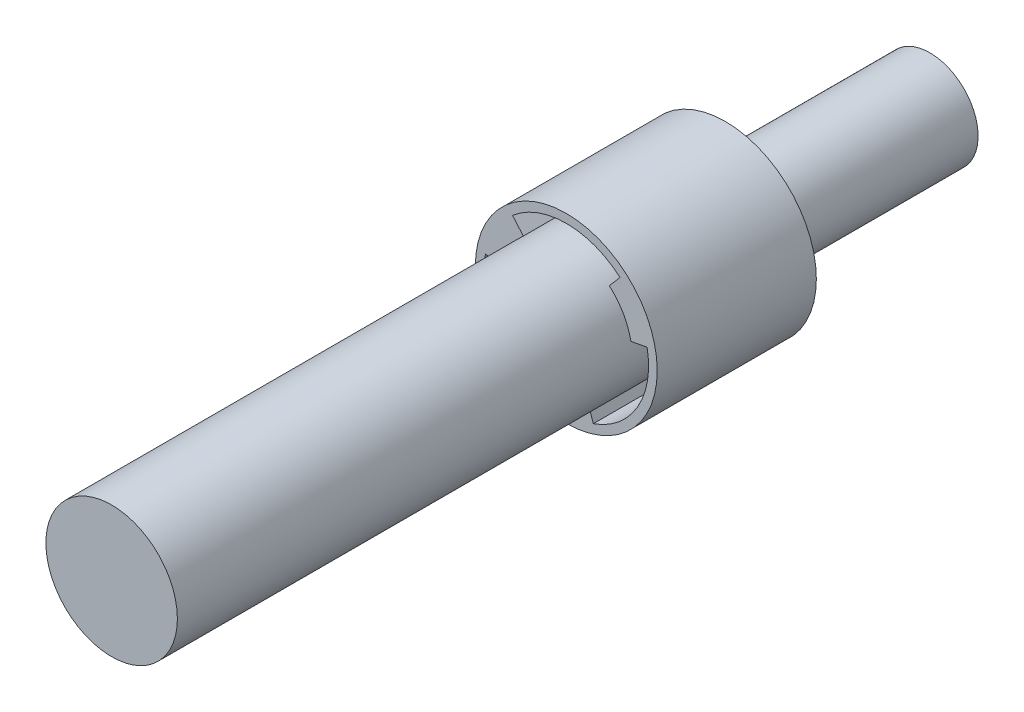
ISO-10303-21;
HEADER;
FILE_DESCRIPTION(('STEP AP214'),'2;1');
FILE_NAME('part.step','',(''),(''),'','','');
FILE_SCHEMA(('AUTOMOTIVE_DESIGN { 1 0 10303 214 1 1 1 1 }'));
ENDSEC;
DATA;
#1=APPLICATION_CONTEXT('core data for automotive mechanical design processes');
#2=APPLICATION_PROTOCOL_DEFINITION('international standard','automotive_design',2000,#1);
#3=PRODUCT_CONTEXT('',#1,'mechanical');
#4=PRODUCT('Part','Part','',(#3));
#5=PRODUCT_RELATED_PRODUCT_CATEGORY('part','',(#4));
#6=PRODUCT_DEFINITION_FORMATION('','',#4);
#7=PRODUCT_DEFINITION_CONTEXT('part definition',#1,'design');
#8=PRODUCT_DEFINITION('design','',#6,#7);
#9=PRODUCT_DEFINITION_SHAPE('','',#8);
#10=(LENGTH_UNIT() NAMED_UNIT(*) SI_UNIT(.MILLI.,.METRE.));
#11=(NAMED_UNIT(*) PLANE_ANGLE_UNIT() SI_UNIT($,.RADIAN.));
#12=(NAMED_UNIT(*) SI_UNIT($,.STERADIAN.) SOLID_ANGLE_UNIT());
#13=UNCERTAINTY_MEASURE_WITH_UNIT(LENGTH_MEASURE(1.E-05),#10,'distance_accuracy_value','');
#14=(GEOMETRIC_REPRESENTATION_CONTEXT(3) GLOBAL_UNCERTAINTY_ASSIGNED_CONTEXT((#13)) GLOBAL_UNIT_ASSIGNED_CONTEXT((#10,
#11,#12)) REPRESENTATION_CONTEXT('',''));
#15=CARTESIAN_POINT('',(0.,0.,0.));
#16=DIRECTION('',(0.,0.,1.));
#17=DIRECTION('',(1.,0.,0.));
#18=AXIS2_PLACEMENT_3D('',#15,#16,#17);
#19=CARTESIAN_POINT('',(0.,0.,101.6));
#20=DIRECTION('',(0.,0.,-1.));
#21=DIRECTION('',(-1.,0.,0.));
#22=AXIS2_PLACEMENT_3D('',#19,#20,#21);
#23=CYLINDRICAL_SURFACE('',#22,14.6939);
#24=CARTESIAN_POINT('',(0.,0.,101.6));
#25=DIRECTION('',(0.,0.,1.));
#26=DIRECTION('',(1.,0.,0.));
#27=AXIS2_PLACEMENT_3D('',#24,#25,#26);
#28=CIRCLE('',#27,14.6939);
#29=CARTESIAN_POINT('',(14.6939,0.,101.6));
#30=VERTEX_POINT('',#29);
#31=EDGE_CURVE('E40',#30,#30,#28,.T.);
#32=ORIENTED_EDGE('',*,*,#31,.F.);
#33=EDGE_LOOP('',(#32));
#34=FACE_BOUND('',#33,.T.);
#35=CARTESIAN_POINT('',(0.,0.,0.));
#36=DIRECTION('',(0.,0.,1.));
#37=DIRECTION('',(1.,0.,0.));
#38=AXIS2_PLACEMENT_3D('',#35,#36,#37);
#39=CIRCLE('',#38,14.6939);
#40=CARTESIAN_POINT('',(14.4332299985732,2.75546167062584,0.));
#41=VERTEX_POINT('',#40);
#42=CARTESIAN_POINT('',(9.60291480520306,11.1218130021149,0.));
#43=VERTEX_POINT('',#42);
#44=EDGE_CURVE('E35',#41,#43,#39,.T.);
#45=ORIENTED_EDGE('',*,*,#44,.T.);
#46=DIRECTION('',(0.,0.,1.));
#47=VECTOR('',#46,1.);
#48=CARTESIAN_POINT('',(9.60291480520306,11.1218130021149,-14.1986));
#49=LINE('',#48,#47);
#50=CARTESIAN_POINT('',(9.60291480520306,11.1218130021149,-14.1986));
#51=VERTEX_POINT('',#50);
#52=EDGE_CURVE('E151',#51,#43,#49,.T.);
#53=ORIENTED_EDGE('',*,*,#52,.F.);
#54=CARTESIAN_POINT('',(0.,0.,-14.1986));
#55=DIRECTION('',(0.,0.,1.));
#56=DIRECTION('',(1.,0.,0.));
#57=AXIS2_PLACEMENT_3D('',#54,#55,#56);
#58=CIRCLE('',#57,14.6939);
#59=CARTESIAN_POINT('',(-9.60291480520291,11.121813002115,-14.1986));
#60=VERTEX_POINT('',#59);
#61=EDGE_CURVE('E168',#60,#51,#58,.F.);
#62=ORIENTED_EDGE('',*,*,#61,.F.);
#63=DIRECTION('',(0.,0.,1.));
#64=VECTOR('',#63,1.);
#65=CARTESIAN_POINT('',(-9.60291480520291,11.121813002115,-14.1986));
#66=LINE('',#65,#64);
#67=CARTESIAN_POINT('',(-9.60291480520291,11.121813002115,0.));
#68=VERTEX_POINT('',#67);
#69=EDGE_CURVE('E179',#60,#68,#66,.T.);
#70=ORIENTED_EDGE('',*,*,#69,.T.);
#71=CARTESIAN_POINT('',(-14.4332299985731,2.75546167062604,0.));
#72=VERTEX_POINT('',#71);
#73=EDGE_CURVE('E224',#68,#72,#39,.T.);
#74=ORIENTED_EDGE('',*,*,#73,.T.);
#75=DIRECTION('',(0.,0.,1.));
#76=VECTOR('',#75,1.);
#77=CARTESIAN_POINT('',(-14.4332299985731,2.75546167062604,-14.1986));
#78=LINE('',#77,#76);
#79=CARTESIAN_POINT('',(-14.4332299985731,2.75546167062604,-14.1986));
#80=VERTEX_POINT('',#79);
#81=EDGE_CURVE('E203',#80,#72,#78,.T.);
#82=ORIENTED_EDGE('',*,*,#81,.F.);
#83=CARTESIAN_POINT('',(0.,0.,-14.1986));
#84=DIRECTION('',(0.,0.,1.));
#85=DIRECTION('',(1.,0.,0.));
#86=AXIS2_PLACEMENT_3D('',#83,#84,#85);
#87=CIRCLE('',#86,14.6939);
#88=CARTESIAN_POINT('',(-4.83031519337016,-13.8772746727409,-14.1986));
#89=VERTEX_POINT('',#88);
#90=EDGE_CURVE('E193',#89,#80,#87,.F.);
#91=ORIENTED_EDGE('',*,*,#90,.F.);
#92=DIRECTION('',(0.,0.,1.));
#93=VECTOR('',#92,1.);
#94=CARTESIAN_POINT('',(-4.83031519337016,-13.8772746727409,-14.1986));
#95=LINE('',#94,#93);
#96=CARTESIAN_POINT('',(-4.83031519337016,-13.8772746727409,0.));
#97=VERTEX_POINT('',#96);
#98=EDGE_CURVE('E206',#89,#97,#95,.T.);
#99=ORIENTED_EDGE('',*,*,#98,.T.);
#100=CARTESIAN_POINT('',(4.83031519337016,-13.8772746727409,0.));
#101=VERTEX_POINT('',#100);
#102=EDGE_CURVE('E218',#97,#101,#39,.T.);
#103=ORIENTED_EDGE('',*,*,#102,.T.);
#104=DIRECTION('',(0.,0.,1.));
#105=VECTOR('',#104,1.);
#106=CARTESIAN_POINT('',(4.83031519337016,-13.8772746727409,-14.1986));
#107=LINE('',#106,#105);
#108=CARTESIAN_POINT('',(4.83031519337016,-13.8772746727409,-14.1986));
#109=VERTEX_POINT('',#108);
#110=EDGE_CURVE('E153',#109,#101,#107,.T.);
#111=ORIENTED_EDGE('',*,*,#110,.F.);
#112=CARTESIAN_POINT('',(0.,0.,-14.1986));
#113=DIRECTION('',(0.,0.,1.));
#114=DIRECTION('',(1.,0.,0.));
#115=AXIS2_PLACEMENT_3D('',#112,#113,#114);
#116=CIRCLE('',#115,14.6939);
#117=CARTESIAN_POINT('',(14.4332299985732,2.75546167062584,-14.1986));
#118=VERTEX_POINT('',#117);
#119=EDGE_CURVE('E130',#118,#109,#116,.F.);
#120=ORIENTED_EDGE('',*,*,#119,.F.);
#121=DIRECTION('',(0.,0.,1.));
#122=VECTOR('',#121,1.);
#123=CARTESIAN_POINT('',(14.4332299985732,2.75546167062584,-14.1986));
#124=LINE('',#123,#122);
#125=EDGE_CURVE('E156',#118,#41,#124,.T.);
#126=ORIENTED_EDGE('',*,*,#125,.T.);
#127=EDGE_LOOP('',(#45,#53,#62,#70,#74,#82,#91,#99,#103,#111,#120,#126));
#128=FACE_BOUND('',#127,.T.);
#129=ADVANCED_FACE('F32',(#34,#128),#23,.T.);
#130=CARTESIAN_POINT('',(0.,0.,101.6));
#131=DIRECTION('',(0.,0.,1.));
#132=DIRECTION('',(1.,0.,0.));
#133=AXIS2_PLACEMENT_3D('',#130,#131,#132);
#134=PLANE('',#133);
#135=ORIENTED_EDGE('',*,*,#31,.T.);
#136=EDGE_LOOP('',(#135));
#137=FACE_BOUND('',#136,.T.);
#138=ADVANCED_FACE('F251',(#137),#134,.T.);
#139=CARTESIAN_POINT('',(0.,0.,-35.56));
#140=DIRECTION('',(0.,0.,1.));
#141=DIRECTION('',(1.,0.,0.));
#142=AXIS2_PLACEMENT_3D('',#139,#140,#141);
#143=CYLINDRICAL_SURFACE('',#142,20.32);
#144=CARTESIAN_POINT('',(0.,0.,-35.56));
#145=DIRECTION('',(0.,0.,-1.));
#146=DIRECTION('',(-1.,0.,0.));
#147=AXIS2_PLACEMENT_3D('',#144,#145,#146);
#148=CIRCLE('',#147,20.32);
#149=CARTESIAN_POINT('',(-20.32,0.,-35.56));
#150=VERTEX_POINT('',#149);
#151=EDGE_CURVE('E215',#150,#150,#148,.T.);
#152=ORIENTED_EDGE('',*,*,#151,.F.);
#153=EDGE_LOOP('',(#152));
#154=FACE_BOUND('',#153,.T.);
#155=CARTESIAN_POINT('',(0.,0.,0.));
#156=DIRECTION('',(0.,0.,-1.));
#157=DIRECTION('',(-1.,0.,0.));
#158=AXIS2_PLACEMENT_3D('',#155,#156,#157);
#159=CIRCLE('',#158,20.32);
#160=CARTESIAN_POINT('',(-20.32,0.,0.));
#161=VERTEX_POINT('',#160);
#162=EDGE_CURVE('E213',#161,#161,#159,.T.);
#163=ORIENTED_EDGE('',*,*,#162,.T.);
#164=EDGE_LOOP('',(#163));
#165=FACE_BOUND('',#164,.T.);
#166=ADVANCED_FACE('F258',(#154,#165),#143,.T.);
#167=CARTESIAN_POINT('',(0.,0.,-35.56));
#168=DIRECTION('',(0.,0.,-1.));
#169=DIRECTION('',(-1.,0.,0.));
#170=AXIS2_PLACEMENT_3D('',#167,#168,#169);
#171=PLANE('',#170);
#172=CARTESIAN_POINT('',(0.,0.,-35.56));
#173=DIRECTION('',(0.,0.,-1.));
#174=DIRECTION('',(-1.,0.,0.));
#175=AXIS2_PLACEMENT_3D('',#172,#173,#174);
#176=CIRCLE('',#175,10.7442);
#177=CARTESIAN_POINT('',(-10.7442,0.,-35.56));
#178=VERTEX_POINT('',#177);
#179=EDGE_CURVE('E11',#178,#178,#176,.T.);
#180=ORIENTED_EDGE('',*,*,#179,.F.);
#181=EDGE_LOOP('',(#180));
#182=FACE_BOUND('',#181,.T.);
#183=ORIENTED_EDGE('',*,*,#151,.T.);
#184=EDGE_LOOP('',(#183));
#185=FACE_BOUND('',#184,.T.);
#186=ADVANCED_FACE('F262',(#182,#185),#171,.T.);
#187=CARTESIAN_POINT('',(0.,0.,0.));
#188=DIRECTION('',(0.,0.,-1.));
#189=DIRECTION('',(-1.,0.,0.));
#190=AXIS2_PLACEMENT_3D('',#187,#188,#189);
#191=PLANE('',#190);
#192=CARTESIAN_POINT('',(0.,0.,0.));
#193=DIRECTION('',(0.,0.,1.));
#194=DIRECTION('',(1.,0.,0.));
#195=AXIS2_PLACEMENT_3D('',#192,#193,#194);
#196=CIRCLE('',#195,18.3896);
#197=CARTESIAN_POINT('',(12.0181682263907,13.9190883552829,0.));
#198=VERTEX_POINT('',#197);
#199=CARTESIAN_POINT('',(-12.0181682263905,13.9190883552831,0.));
#200=VERTEX_POINT('',#199);
#201=EDGE_CURVE('E173',#198,#200,#196,.T.);
#202=ORIENTED_EDGE('',*,*,#201,.F.);
#203=DIRECTION('',(0.653530703571078,0.756900006268921,0.));
#204=VECTOR('',#203,1.);
#205=CARTESIAN_POINT('',(0.,0.,0.));
#206=LINE('',#205,#204);
#207=EDGE_CURVE('E48',#43,#198,#206,.T.);
#208=ORIENTED_EDGE('',*,*,#207,.F.);
#209=ORIENTED_EDGE('',*,*,#44,.F.);
#210=DIRECTION('',(0.982259985339029,0.187524188311193,0.));
#211=VECTOR('',#210,1.);
#212=CARTESIAN_POINT('',(0.,0.,0.));
#213=LINE('',#212,#211);
#214=CARTESIAN_POINT('',(18.0633682263906,3.44849481336751,0.));
#215=VERTEX_POINT('',#214);
#216=EDGE_CURVE('E142',#41,#215,#213,.T.);
#217=ORIENTED_EDGE('',*,*,#216,.T.);
#218=CARTESIAN_POINT('',(0.,0.,0.));
#219=DIRECTION('',(0.,0.,1.));
#220=DIRECTION('',(1.,0.,0.));
#221=AXIS2_PLACEMENT_3D('',#218,#219,#220);
#222=CIRCLE('',#221,18.3896);
#223=CARTESIAN_POINT('',(6.0452,-17.3675831686507,0.));
#224=VERTEX_POINT('',#223);
#225=EDGE_CURVE('E145',#224,#215,#222,.T.);
#226=ORIENTED_EDGE('',*,*,#225,.F.);
#227=DIRECTION('',(0.328729281767956,-0.944424194580128,0.));
#228=VECTOR('',#227,1.);
#229=CARTESIAN_POINT('',(0.,0.,0.));
#230=LINE('',#229,#228);
#231=EDGE_CURVE('E56',#101,#224,#230,.T.);
#232=ORIENTED_EDGE('',*,*,#231,.F.);
#233=ORIENTED_EDGE('',*,*,#102,.F.);
#234=DIRECTION('',(-0.328729281767956,-0.944424194580128,0.));
#235=VECTOR('',#234,1.);
#236=CARTESIAN_POINT('',(0.,0.,0.));
#237=LINE('',#236,#235);
#238=CARTESIAN_POINT('',(-6.0452,-17.3675831686507,0.));
#239=VERTEX_POINT('',#238);
#240=EDGE_CURVE('E188',#97,#239,#237,.T.);
#241=ORIENTED_EDGE('',*,*,#240,.T.);
#242=CARTESIAN_POINT('',(0.,0.,0.));
#243=DIRECTION('',(0.,0.,1.));
#244=DIRECTION('',(1.,0.,0.));
#245=AXIS2_PLACEMENT_3D('',#242,#243,#244);
#246=CIRCLE('',#245,18.3896);
#247=CARTESIAN_POINT('',(-18.0633682263906,3.44849481336776,0.));
#248=VERTEX_POINT('',#247);
#249=EDGE_CURVE('E198',#248,#239,#246,.T.);
#250=ORIENTED_EDGE('',*,*,#249,.F.);
#251=DIRECTION('',(-0.982259985339026,0.187524188311206,0.));
#252=VECTOR('',#251,1.);
#253=CARTESIAN_POINT('',(0.,0.,0.));
#254=LINE('',#253,#252);
#255=EDGE_CURVE('E155',#72,#248,#254,.T.);
#256=ORIENTED_EDGE('',*,*,#255,.F.);
#257=ORIENTED_EDGE('',*,*,#73,.F.);
#258=DIRECTION('',(-0.653530703571067,0.75690000626893,0.));
#259=VECTOR('',#258,1.);
#260=CARTESIAN_POINT('',(0.,0.,0.));
#261=LINE('',#260,#259);
#262=EDGE_CURVE('E163',#68,#200,#261,.T.);
#263=ORIENTED_EDGE('',*,*,#262,.T.);
#264=EDGE_LOOP('',(#202,#208,#209,#217,#226,#232,#233,#241,#250,#256,#257,#263));
#265=FACE_BOUND('',#264,.T.);
#266=ORIENTED_EDGE('',*,*,#162,.F.);
#267=EDGE_LOOP('',(#266));
#268=FACE_BOUND('',#267,.T.);
#269=ADVANCED_FACE('F234',(#265,#268),#191,.F.);
#270=CARTESIAN_POINT('',(0.,0.,-81.28));
#271=DIRECTION('',(0.,0.,1.));
#272=DIRECTION('',(1.,0.,0.));
#273=AXIS2_PLACEMENT_3D('',#270,#271,#272);
#274=CYLINDRICAL_SURFACE('',#273,10.7442);
#275=CARTESIAN_POINT('',(0.,0.,-81.28));
#276=DIRECTION('',(0.,0.,-1.));
#277=DIRECTION('',(-1.,0.,0.));
#278=AXIS2_PLACEMENT_3D('',#275,#276,#277);
#279=CIRCLE('',#278,10.7442);
#280=CARTESIAN_POINT('',(-10.7442,0.,-81.28));
#281=VERTEX_POINT('',#280);
#282=EDGE_CURVE('E205',#281,#281,#279,.T.);
#283=ORIENTED_EDGE('',*,*,#282,.F.);
#284=EDGE_LOOP('',(#283));
#285=FACE_BOUND('',#284,.T.);
#286=ORIENTED_EDGE('',*,*,#179,.T.);
#287=EDGE_LOOP('',(#286));
#288=FACE_BOUND('',#287,.T.);
#289=ADVANCED_FACE('F268',(#285,#288),#274,.T.);
#290=CARTESIAN_POINT('',(0.,0.,-81.28));
#291=DIRECTION('',(0.,0.,-1.));
#292=DIRECTION('',(-1.,0.,0.));
#293=AXIS2_PLACEMENT_3D('',#290,#291,#292);
#294=PLANE('',#293);
#295=ORIENTED_EDGE('',*,*,#282,.T.);
#296=EDGE_LOOP('',(#295));
#297=FACE_BOUND('',#296,.T.);
#298=ADVANCED_FACE('F274',(#297),#294,.T.);
#299=CARTESIAN_POINT('',(0.,0.,-14.1986));
#300=DIRECTION('',(0.187524188311206,0.982259985339026,0.));
#301=DIRECTION('',(-0.982259985339026,0.187524188311206,0.));
#302=AXIS2_PLACEMENT_3D('',#299,#300,#301);
#303=PLANE('',#302);
#304=ORIENTED_EDGE('',*,*,#255,.T.);
#305=DIRECTION('',(0.,0.,1.));
#306=VECTOR('',#305,1.);
#307=CARTESIAN_POINT('',(-18.0633682263906,3.44849481336776,-14.1986));
#308=LINE('',#307,#306);
#309=CARTESIAN_POINT('',(-18.0633682263906,3.44849481336776,-14.1986));
#310=VERTEX_POINT('',#309);
#311=EDGE_CURVE('E196',#310,#248,#308,.T.);
#312=ORIENTED_EDGE('',*,*,#311,.F.);
#313=DIRECTION('',(-0.982259985339026,0.187524188311206,0.));
#314=VECTOR('',#313,1.);
#315=CARTESIAN_POINT('',(0.,0.,-14.1986));
#316=LINE('',#315,#314);
#317=EDGE_CURVE('E184',#80,#310,#316,.T.);
#318=ORIENTED_EDGE('',*,*,#317,.F.);
#319=ORIENTED_EDGE('',*,*,#81,.T.);
#320=EDGE_LOOP('',(#304,#312,#318,#319));
#321=FACE_BOUND('',#320,.T.);
#322=ADVANCED_FACE('F277',(#321),#303,.F.);
#323=CARTESIAN_POINT('',(0.,0.,-14.1986));
#324=DIRECTION('',(-0.944424194580128,0.328729281767956,0.));
#325=DIRECTION('',(-0.328729281767956,-0.944424194580128,0.));
#326=AXIS2_PLACEMENT_3D('',#323,#324,#325);
#327=PLANE('',#326);
#328=ORIENTED_EDGE('',*,*,#240,.F.);
#329=ORIENTED_EDGE('',*,*,#98,.F.);
#330=DIRECTION('',(-0.328729281767956,-0.944424194580128,0.));
#331=VECTOR('',#330,1.);
#332=CARTESIAN_POINT('',(0.,0.,-14.1986));
#333=LINE('',#332,#331);
#334=CARTESIAN_POINT('',(-6.0452,-17.3675831686507,-14.1986));
#335=VERTEX_POINT('',#334);
#336=EDGE_CURVE('E191',#89,#335,#333,.T.);
#337=ORIENTED_EDGE('',*,*,#336,.T.);
#338=DIRECTION('',(0.,0.,1.));
#339=VECTOR('',#338,1.);
#340=CARTESIAN_POINT('',(-6.0452,-17.3675831686507,-14.1986));
#341=LINE('',#340,#339);
#342=EDGE_CURVE('E208',#335,#239,#341,.T.);
#343=ORIENTED_EDGE('',*,*,#342,.T.);
#344=EDGE_LOOP('',(#328,#329,#337,#343));
#345=FACE_BOUND('',#344,.T.);
#346=ADVANCED_FACE('F280',(#345),#327,.T.);
#347=CARTESIAN_POINT('',(0.,0.,-14.1986));
#348=DIRECTION('',(0.,0.,1.));
#349=DIRECTION('',(1.,0.,0.));
#350=AXIS2_PLACEMENT_3D('',#347,#348,#349);
#351=CYLINDRICAL_SURFACE('',#350,18.3896);
#352=ORIENTED_EDGE('',*,*,#249,.T.);
#353=ORIENTED_EDGE('',*,*,#342,.F.);
#354=CARTESIAN_POINT('',(0.,0.,-14.1986));
#355=DIRECTION('',(0.,0.,1.));
#356=DIRECTION('',(1.,0.,0.));
#357=AXIS2_PLACEMENT_3D('',#354,#355,#356);
#358=CIRCLE('',#357,18.3896);
#359=EDGE_CURVE('E187',#310,#335,#358,.T.);
#360=ORIENTED_EDGE('',*,*,#359,.F.);
#361=ORIENTED_EDGE('',*,*,#311,.T.);
#362=EDGE_LOOP('',(#352,#353,#360,#361));
#363=FACE_BOUND('',#362,.T.);
#364=ADVANCED_FACE('F282',(#363),#351,.F.);
#365=CARTESIAN_POINT('',(0.,0.,-14.1986));
#366=DIRECTION('',(0.,0.,1.));
#367=DIRECTION('',(1.,0.,0.));
#368=AXIS2_PLACEMENT_3D('',#365,#366,#367);
#369=PLANE('',#368);
#370=ORIENTED_EDGE('',*,*,#317,.T.);
#371=ORIENTED_EDGE('',*,*,#359,.T.);
#372=ORIENTED_EDGE('',*,*,#336,.F.);
#373=ORIENTED_EDGE('',*,*,#90,.T.);
#374=EDGE_LOOP('',(#370,#371,#372,#373));
#375=FACE_BOUND('',#374,.T.);
#376=ADVANCED_FACE('F247',(#375),#369,.T.);
#377=CARTESIAN_POINT('',(0.,0.,-14.1986));
#378=DIRECTION('',(-0.944424194580128,-0.328729281767956,0.));
#379=DIRECTION('',(0.328729281767956,-0.944424194580128,0.));
#380=AXIS2_PLACEMENT_3D('',#377,#378,#379);
#381=PLANE('',#380);
#382=ORIENTED_EDGE('',*,*,#231,.T.);
#383=DIRECTION('',(0.,0.,1.));
#384=VECTOR('',#383,1.);
#385=CARTESIAN_POINT('',(6.0452,-17.3675831686507,-14.1986));
#386=LINE('',#385,#384);
#387=CARTESIAN_POINT('',(6.0452,-17.3675831686507,-14.1986));
#388=VERTEX_POINT('',#387);
#389=EDGE_CURVE('E120',#388,#224,#386,.T.);
#390=ORIENTED_EDGE('',*,*,#389,.F.);
#391=DIRECTION('',(0.328729281767956,-0.944424194580128,0.));
#392=VECTOR('',#391,1.);
#393=CARTESIAN_POINT('',(0.,0.,-14.1986));
#394=LINE('',#393,#392);
#395=EDGE_CURVE('E124',#109,#388,#394,.T.);
#396=ORIENTED_EDGE('',*,*,#395,.F.);
#397=ORIENTED_EDGE('',*,*,#110,.T.);
#398=EDGE_LOOP('',(#382,#390,#396,#397));
#399=FACE_BOUND('',#398,.T.);
#400=ADVANCED_FACE('F122',(#399),#381,.F.);
#401=CARTESIAN_POINT('',(0.,0.,-14.1986));
#402=DIRECTION('',(0.187524188311193,-0.982259985339028,0.));
#403=DIRECTION('',(0.982259985339029,0.187524188311193,0.));
#404=AXIS2_PLACEMENT_3D('',#401,#402,#403);
#405=PLANE('',#404);
#406=ORIENTED_EDGE('',*,*,#216,.F.);
#407=ORIENTED_EDGE('',*,*,#125,.F.);
#408=DIRECTION('',(0.982259985339029,0.187524188311193,0.));
#409=VECTOR('',#408,1.);
#410=CARTESIAN_POINT('',(0.,0.,-14.1986));
#411=LINE('',#410,#409);
#412=CARTESIAN_POINT('',(18.0633682263906,3.44849481336751,-14.1986));
#413=VERTEX_POINT('',#412);
#414=EDGE_CURVE('E138',#118,#413,#411,.T.);
#415=ORIENTED_EDGE('',*,*,#414,.T.);
#416=DIRECTION('',(0.,0.,1.));
#417=VECTOR('',#416,1.);
#418=CARTESIAN_POINT('',(18.0633682263906,3.44849481336751,-14.1986));
#419=LINE('',#418,#417);
#420=EDGE_CURVE('E129',#413,#215,#419,.T.);
#421=ORIENTED_EDGE('',*,*,#420,.T.);
#422=EDGE_LOOP('',(#406,#407,#415,#421));
#423=FACE_BOUND('',#422,.T.);
#424=ADVANCED_FACE('F239',(#423),#405,.T.);
#425=CARTESIAN_POINT('',(0.,0.,-14.1986));
#426=DIRECTION('',(0.,0.,1.));
#427=DIRECTION('',(1.,0.,0.));
#428=AXIS2_PLACEMENT_3D('',#425,#426,#427);
#429=CYLINDRICAL_SURFACE('',#428,18.3896);
#430=ORIENTED_EDGE('',*,*,#225,.T.);
#431=ORIENTED_EDGE('',*,*,#420,.F.);
#432=CARTESIAN_POINT('',(0.,0.,-14.1986));
#433=DIRECTION('',(0.,0.,1.));
#434=DIRECTION('',(1.,0.,0.));
#435=AXIS2_PLACEMENT_3D('',#432,#433,#434);
#436=CIRCLE('',#435,18.3896);
#437=EDGE_CURVE('E134',#388,#413,#436,.T.);
#438=ORIENTED_EDGE('',*,*,#437,.F.);
#439=ORIENTED_EDGE('',*,*,#389,.T.);
#440=EDGE_LOOP('',(#430,#431,#438,#439));
#441=FACE_BOUND('',#440,.T.);
#442=ADVANCED_FACE('F135',(#441),#429,.F.);
#443=CARTESIAN_POINT('',(0.,0.,-14.1986));
#444=DIRECTION('',(0.,0.,1.));
#445=DIRECTION('',(1.,0.,0.));
#446=AXIS2_PLACEMENT_3D('',#443,#444,#445);
#447=PLANE('',#446);
#448=ORIENTED_EDGE('',*,*,#395,.T.);
#449=ORIENTED_EDGE('',*,*,#437,.T.);
#450=ORIENTED_EDGE('',*,*,#414,.F.);
#451=ORIENTED_EDGE('',*,*,#119,.T.);
#452=EDGE_LOOP('',(#448,#449,#450,#451));
#453=FACE_BOUND('',#452,.T.);
#454=ADVANCED_FACE('F140',(#453),#447,.T.);
#455=CARTESIAN_POINT('',(0.,0.,-14.1986));
#456=DIRECTION('',(0.756900006268921,-0.653530703571078,0.));
#457=DIRECTION('',(0.653530703571078,0.756900006268921,0.));
#458=AXIS2_PLACEMENT_3D('',#455,#456,#457);
#459=PLANE('',#458);
#460=ORIENTED_EDGE('',*,*,#207,.T.);
#461=DIRECTION('',(0.,0.,1.));
#462=VECTOR('',#461,1.);
#463=CARTESIAN_POINT('',(12.0181682263907,13.9190883552829,-14.1986));
#464=LINE('',#463,#462);
#465=CARTESIAN_POINT('',(12.0181682263907,13.9190883552829,-14.1986));
#466=VERTEX_POINT('',#465);
#467=EDGE_CURVE('E171',#466,#198,#464,.T.);
#468=ORIENTED_EDGE('',*,*,#467,.F.);
#469=DIRECTION('',(0.653530703571078,0.756900006268921,0.));
#470=VECTOR('',#469,1.);
#471=CARTESIAN_POINT('',(0.,0.,-14.1986));
#472=LINE('',#471,#470);
#473=EDGE_CURVE('E159',#51,#466,#472,.T.);
#474=ORIENTED_EDGE('',*,*,#473,.F.);
#475=ORIENTED_EDGE('',*,*,#52,.T.);
#476=EDGE_LOOP('',(#460,#468,#474,#475));
#477=FACE_BOUND('',#476,.T.);
#478=ADVANCED_FACE('F292',(#477),#459,.F.);
#479=CARTESIAN_POINT('',(0.,0.,-14.1986));
#480=DIRECTION('',(0.75690000626893,0.653530703571067,0.));
#481=DIRECTION('',(-0.653530703571067,0.75690000626893,0.));
#482=AXIS2_PLACEMENT_3D('',#479,#480,#481);
#483=PLANE('',#482);
#484=ORIENTED_EDGE('',*,*,#262,.F.);
#485=ORIENTED_EDGE('',*,*,#69,.F.);
#486=DIRECTION('',(-0.653530703571067,0.75690000626893,0.));
#487=VECTOR('',#486,1.);
#488=CARTESIAN_POINT('',(0.,0.,-14.1986));
#489=LINE('',#488,#487);
#490=CARTESIAN_POINT('',(-12.0181682263905,13.9190883552831,-14.1986));
#491=VERTEX_POINT('',#490);
#492=EDGE_CURVE('E166',#60,#491,#489,.T.);
#493=ORIENTED_EDGE('',*,*,#492,.T.);
#494=DIRECTION('',(0.,0.,1.));
#495=VECTOR('',#494,1.);
#496=CARTESIAN_POINT('',(-12.0181682263905,13.9190883552831,-14.1986));
#497=LINE('',#496,#495);
#498=EDGE_CURVE('E181',#491,#200,#497,.T.);
#499=ORIENTED_EDGE('',*,*,#498,.T.);
#500=EDGE_LOOP('',(#484,#485,#493,#499));
#501=FACE_BOUND('',#500,.T.);
#502=ADVANCED_FACE('F295',(#501),#483,.T.);
#503=CARTESIAN_POINT('',(0.,0.,-14.1986));
#504=DIRECTION('',(0.,0.,1.));
#505=DIRECTION('',(1.,0.,0.));
#506=AXIS2_PLACEMENT_3D('',#503,#504,#505);
#507=CYLINDRICAL_SURFACE('',#506,18.3896);
#508=ORIENTED_EDGE('',*,*,#201,.T.);
#509=ORIENTED_EDGE('',*,*,#498,.F.);
#510=CARTESIAN_POINT('',(0.,0.,-14.1986));
#511=DIRECTION('',(0.,0.,1.));
#512=DIRECTION('',(1.,0.,0.));
#513=AXIS2_PLACEMENT_3D('',#510,#511,#512);
#514=CIRCLE('',#513,18.3896);
#515=EDGE_CURVE('E162',#466,#491,#514,.T.);
#516=ORIENTED_EDGE('',*,*,#515,.F.);
#517=ORIENTED_EDGE('',*,*,#467,.T.);
#518=EDGE_LOOP('',(#508,#509,#516,#517));
#519=FACE_BOUND('',#518,.T.);
#520=ADVANCED_FACE('F296',(#519),#507,.F.);
#521=CARTESIAN_POINT('',(0.,0.,-14.1986));
#522=DIRECTION('',(0.,0.,1.));
#523=DIRECTION('',(1.,0.,0.));
#524=AXIS2_PLACEMENT_3D('',#521,#522,#523);
#525=PLANE('',#524);
#526=ORIENTED_EDGE('',*,*,#473,.T.);
#527=ORIENTED_EDGE('',*,*,#515,.T.);
#528=ORIENTED_EDGE('',*,*,#492,.F.);
#529=ORIENTED_EDGE('',*,*,#61,.T.);
#530=EDGE_LOOP('',(#526,#527,#528,#529));
#531=FACE_BOUND('',#530,.T.);
#532=ADVANCED_FACE('F299',(#531),#525,.T.);
#533=CLOSED_SHELL('',(#129,#138,#166,#186,#269,#289,#298,#322,#346,#364,#376,#400,#424,#442,
#454,#478,#502,#520,#532));
#534=MANIFOLD_SOLID_BREP('B2',#533);
#535=ADVANCED_BREP_SHAPE_REPRESENTATION('',(#18,#534),#14);
#536=SHAPE_DEFINITION_REPRESENTATION(#9,#535);
ENDSEC;
END-ISO-10303-21;
